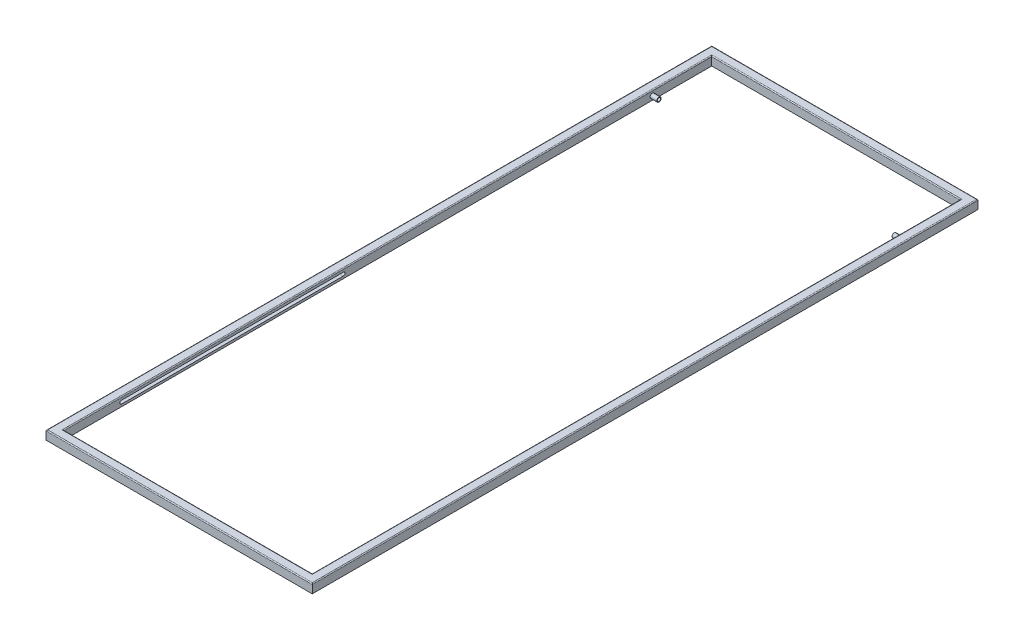
ISO-10303-21;
HEADER;
FILE_DESCRIPTION(('STEP AP214'),'2;1');
FILE_NAME('part.step','',(''),(''),'','','');
FILE_SCHEMA(('AUTOMOTIVE_DESIGN { 1 0 10303 214 1 1 1 1 }'));
ENDSEC;
DATA;
#1=APPLICATION_CONTEXT('core data for automotive mechanical design processes');
#2=APPLICATION_PROTOCOL_DEFINITION('international standard','automotive_design',2000,#1);
#3=PRODUCT_CONTEXT('',#1,'mechanical');
#4=PRODUCT('Part','Part','',(#3));
#5=PRODUCT_RELATED_PRODUCT_CATEGORY('part','',(#4));
#6=PRODUCT_DEFINITION_FORMATION('','',#4);
#7=PRODUCT_DEFINITION_CONTEXT('part definition',#1,'design');
#8=PRODUCT_DEFINITION('design','',#6,#7);
#9=PRODUCT_DEFINITION_SHAPE('','',#8);
#10=(LENGTH_UNIT() NAMED_UNIT(*) SI_UNIT(.MILLI.,.METRE.));
#11=(NAMED_UNIT(*) PLANE_ANGLE_UNIT() SI_UNIT($,.RADIAN.));
#12=(NAMED_UNIT(*) SI_UNIT($,.STERADIAN.) SOLID_ANGLE_UNIT());
#13=UNCERTAINTY_MEASURE_WITH_UNIT(LENGTH_MEASURE(1.E-05),#10,'distance_accuracy_value','');
#14=(GEOMETRIC_REPRESENTATION_CONTEXT(3) GLOBAL_UNCERTAINTY_ASSIGNED_CONTEXT((#13)) GLOBAL_UNIT_ASSIGNED_CONTEXT((#10,
#11,#12)) REPRESENTATION_CONTEXT('',''));
#15=CARTESIAN_POINT('',(0.,0.,0.));
#16=DIRECTION('',(0.,0.,1.));
#17=DIRECTION('',(1.,0.,0.));
#18=AXIS2_PLACEMENT_3D('',#15,#16,#17);
#19=CARTESIAN_POINT('',(0.,26.,0.));
#20=DIRECTION('',(0.,-1.,0.));
#21=DIRECTION('',(0.,0.,-1.));
#22=AXIS2_PLACEMENT_3D('',#19,#20,#21);
#23=PLANE('',#22);
#24=DIRECTION('',(0.,0.,1.));
#25=VECTOR('',#24,1.);
#26=CARTESIAN_POINT('',(-366.6,26.,-949.));
#27=LINE('',#26,#25);
#28=CARTESIAN_POINT('',(-366.6,26.,951.6));
#29=VERTEX_POINT('',#28);
#30=CARTESIAN_POINT('',(-366.6,26.,-951.6));
#31=VERTEX_POINT('',#30);
#32=EDGE_CURVE('E363',#29,#31,#27,.F.);
#33=ORIENTED_EDGE('',*,*,#32,.T.);
#34=DIRECTION('',(-1.,0.,0.));
#35=VECTOR('',#34,1.);
#36=CARTESIAN_POINT('',(364.,26.,-951.6));
#37=LINE('',#36,#35);
#38=CARTESIAN_POINT('',(366.6,26.,-951.6));
#39=VERTEX_POINT('',#38);
#40=EDGE_CURVE('E372',#31,#39,#37,.F.);
#41=ORIENTED_EDGE('',*,*,#40,.T.);
#42=DIRECTION('',(0.,0.,-1.));
#43=VECTOR('',#42,1.);
#44=CARTESIAN_POINT('',(366.6,26.,949.));
#45=LINE('',#44,#43);
#46=CARTESIAN_POINT('',(366.6,26.,951.6));
#47=VERTEX_POINT('',#46);
#48=EDGE_CURVE('E369',#39,#47,#45,.F.);
#49=ORIENTED_EDGE('',*,*,#48,.T.);
#50=DIRECTION('',(1.,0.,0.));
#51=VECTOR('',#50,1.);
#52=CARTESIAN_POINT('',(-364.,26.,951.6));
#53=LINE('',#52,#51);
#54=EDGE_CURVE('E366',#47,#29,#53,.F.);
#55=ORIENTED_EDGE('',*,*,#54,.T.);
#56=EDGE_LOOP('',(#33,#41,#49,#55));
#57=FACE_BOUND('',#56,.T.);
#58=DIRECTION('',(0.,0.,-1.));
#59=VECTOR('',#58,1.);
#60=CARTESIAN_POINT('',(387.4,26.,0.));
#61=LINE('',#60,#59);
#62=CARTESIAN_POINT('',(387.4,26.,972.4));
#63=VERTEX_POINT('',#62);
#64=CARTESIAN_POINT('',(387.4,26.,-972.4));
#65=VERTEX_POINT('',#64);
#66=EDGE_CURVE('E356',#63,#65,#61,.T.);
#67=ORIENTED_EDGE('',*,*,#66,.T.);
#68=DIRECTION('',(-1.,0.,0.));
#69=VECTOR('',#68,1.);
#70=CARTESIAN_POINT('',(0.,26.,-972.4));
#71=LINE('',#70,#69);
#72=CARTESIAN_POINT('',(-387.4,26.,-972.4));
#73=VERTEX_POINT('',#72);
#74=EDGE_CURVE('E359',#65,#73,#71,.T.);
#75=ORIENTED_EDGE('',*,*,#74,.T.);
#76=DIRECTION('',(0.,0.,1.));
#77=VECTOR('',#76,1.);
#78=CARTESIAN_POINT('',(-387.4,26.,0.));
#79=LINE('',#78,#77);
#80=CARTESIAN_POINT('',(-387.4,26.,972.4));
#81=VERTEX_POINT('',#80);
#82=EDGE_CURVE('E350',#73,#81,#79,.T.);
#83=ORIENTED_EDGE('',*,*,#82,.T.);
#84=DIRECTION('',(1.,0.,0.));
#85=VECTOR('',#84,1.);
#86=CARTESIAN_POINT('',(0.,26.,972.4));
#87=LINE('',#86,#85);
#88=EDGE_CURVE('E353',#81,#63,#87,.T.);
#89=ORIENTED_EDGE('',*,*,#88,.T.);
#90=EDGE_LOOP('',(#67,#75,#83,#89));
#91=FACE_BOUND('',#90,.T.);
#92=ADVANCED_FACE('F38',(#57,#91),#23,.F.);
#93=CARTESIAN_POINT('',(0.,0.,0.));
#94=DIRECTION('',(0.,-1.,0.));
#95=DIRECTION('',(0.,0.,-1.));
#96=AXIS2_PLACEMENT_3D('',#93,#94,#95);
#97=PLANE('',#96);
#98=CARTESIAN_POINT('',(-376.999999999999,0.,-962.000000000001));
#99=DIRECTION('',(0.,-1.,0.));
#100=DIRECTION('',(0.,0.,1.));
#101=AXIS2_PLACEMENT_3D('',#98,#99,#100);
#102=CIRCLE('',#101,6.49999999999999);
#103=CARTESIAN_POINT('',(-376.999999999999,0.,-955.500000000001));
#104=VERTEX_POINT('',#103);
#105=EDGE_CURVE('E278',#104,#104,#102,.T.);
#106=ORIENTED_EDGE('',*,*,#105,.F.);
#107=EDGE_LOOP('',(#106));
#108=FACE_BOUND('',#107,.T.);
#109=CARTESIAN_POINT('',(377.000000000001,0.,-962.));
#110=DIRECTION('',(0.,-1.,0.));
#111=DIRECTION('',(0.,0.,-1.));
#112=AXIS2_PLACEMENT_3D('',#109,#110,#111);
#113=CIRCLE('',#112,6.49999999999999);
#114=CARTESIAN_POINT('',(377.000000000001,0.,-968.5));
#115=VERTEX_POINT('',#114);
#116=EDGE_CURVE('E270',#115,#115,#113,.T.);
#117=ORIENTED_EDGE('',*,*,#116,.F.);
#118=EDGE_LOOP('',(#117));
#119=FACE_BOUND('',#118,.T.);
#120=CARTESIAN_POINT('',(377.,0.,962.));
#121=DIRECTION('',(0.,-1.,0.));
#122=DIRECTION('',(0.,0.,1.));
#123=AXIS2_PLACEMENT_3D('',#120,#121,#122);
#124=CIRCLE('',#123,6.49999999999999);
#125=CARTESIAN_POINT('',(377.,0.,968.5));
#126=VERTEX_POINT('',#125);
#127=EDGE_CURVE('E262',#126,#126,#124,.T.);
#128=ORIENTED_EDGE('',*,*,#127,.F.);
#129=EDGE_LOOP('',(#128));
#130=FACE_BOUND('',#129,.T.);
#131=CARTESIAN_POINT('',(-377.,0.,962.));
#132=DIRECTION('',(0.,-1.,0.));
#133=DIRECTION('',(0.,0.,-1.));
#134=AXIS2_PLACEMENT_3D('',#131,#132,#133);
#135=CIRCLE('',#134,6.49999999999999);
#136=CARTESIAN_POINT('',(-377.,0.,955.5));
#137=VERTEX_POINT('',#136);
#138=EDGE_CURVE('E261',#137,#137,#135,.T.);
#139=ORIENTED_EDGE('',*,*,#138,.F.);
#140=EDGE_LOOP('',(#139));
#141=FACE_BOUND('',#140,.T.);
#142=DIRECTION('',(0.,0.,-1.));
#143=VECTOR('',#142,1.);
#144=CARTESIAN_POINT('',(390.,0.,975.));
#145=LINE('',#144,#143);
#146=CARTESIAN_POINT('',(390.,0.,975.));
#147=VERTEX_POINT('',#146);
#148=CARTESIAN_POINT('',(390.,0.,-975.));
#149=VERTEX_POINT('',#148);
#150=EDGE_CURVE('E318',#147,#149,#145,.T.);
#151=ORIENTED_EDGE('',*,*,#150,.F.);
#152=DIRECTION('',(1.,0.,0.));
#153=VECTOR('',#152,1.);
#154=CARTESIAN_POINT('',(-390.,0.,975.));
#155=LINE('',#154,#153);
#156=CARTESIAN_POINT('',(-390.,0.,975.));
#157=VERTEX_POINT('',#156);
#158=EDGE_CURVE('E330',#157,#147,#155,.T.);
#159=ORIENTED_EDGE('',*,*,#158,.F.);
#160=DIRECTION('',(0.,0.,1.));
#161=VECTOR('',#160,1.);
#162=CARTESIAN_POINT('',(-390.,0.,975.));
#163=LINE('',#162,#161);
#164=CARTESIAN_POINT('',(-390.,0.,-975.));
#165=VERTEX_POINT('',#164);
#166=EDGE_CURVE('E326',#165,#157,#163,.T.);
#167=ORIENTED_EDGE('',*,*,#166,.F.);
#168=DIRECTION('',(-1.,0.,0.));
#169=VECTOR('',#168,1.);
#170=CARTESIAN_POINT('',(-390.,0.,-975.));
#171=LINE('',#170,#169);
#172=EDGE_CURVE('E322',#149,#165,#171,.T.);
#173=ORIENTED_EDGE('',*,*,#172,.F.);
#174=EDGE_LOOP('',(#151,#159,#167,#173));
#175=FACE_BOUND('',#174,.T.);
#176=DIRECTION('',(1.,0.,0.));
#177=VECTOR('',#176,1.);
#178=CARTESIAN_POINT('',(-364.,0.,949.));
#179=LINE('',#178,#177);
#180=CARTESIAN_POINT('',(-364.,0.,949.));
#181=VERTEX_POINT('',#180);
#182=CARTESIAN_POINT('',(364.,0.,949.));
#183=VERTEX_POINT('',#182);
#184=EDGE_CURVE('E302',#181,#183,#179,.T.);
#185=ORIENTED_EDGE('',*,*,#184,.T.);
#186=DIRECTION('',(0.,0.,-1.));
#187=VECTOR('',#186,1.);
#188=CARTESIAN_POINT('',(364.,0.,949.));
#189=LINE('',#188,#187);
#190=CARTESIAN_POINT('',(364.,0.,-949.));
#191=VERTEX_POINT('',#190);
#192=EDGE_CURVE('E287',#183,#191,#189,.T.);
#193=ORIENTED_EDGE('',*,*,#192,.T.);
#194=DIRECTION('',(-1.,0.,0.));
#195=VECTOR('',#194,1.);
#196=CARTESIAN_POINT('',(-364.,0.,-949.));
#197=LINE('',#196,#195);
#198=CARTESIAN_POINT('',(-364.,0.,-949.));
#199=VERTEX_POINT('',#198);
#200=EDGE_CURVE('E294',#191,#199,#197,.T.);
#201=ORIENTED_EDGE('',*,*,#200,.T.);
#202=DIRECTION('',(0.,0.,1.));
#203=VECTOR('',#202,1.);
#204=CARTESIAN_POINT('',(-364.,0.,949.));
#205=LINE('',#204,#203);
#206=EDGE_CURVE('E298',#199,#181,#205,.T.);
#207=ORIENTED_EDGE('',*,*,#206,.T.);
#208=EDGE_LOOP('',(#185,#193,#201,#207));
#209=FACE_BOUND('',#208,.T.);
#210=ADVANCED_FACE('F465',(#108,#119,#130,#141,#175,#209),#97,.T.);
#211=CARTESIAN_POINT('',(390.,26.,975.));
#212=DIRECTION('',(-1.,0.,0.));
#213=DIRECTION('',(0.,0.,1.));
#214=AXIS2_PLACEMENT_3D('',#211,#212,#213);
#215=PLANE('',#214);
#216=DIRECTION('',(0.,-1.,0.));
#217=VECTOR('',#216,1.);
#218=CARTESIAN_POINT('',(390.,26.,-975.));
#219=LINE('',#218,#217);
#220=CARTESIAN_POINT('',(390.,23.4,-975.));
#221=VERTEX_POINT('',#220);
#222=EDGE_CURVE('E343',#221,#149,#219,.T.);
#223=ORIENTED_EDGE('',*,*,#222,.F.);
#224=DIRECTION('',(0.,0.,-1.));
#225=VECTOR('',#224,1.);
#226=CARTESIAN_POINT('',(390.,23.4,975.));
#227=LINE('',#226,#225);
#228=CARTESIAN_POINT('',(390.,23.4,975.));
#229=VERTEX_POINT('',#228);
#230=EDGE_CURVE('E383',#221,#229,#227,.F.);
#231=ORIENTED_EDGE('',*,*,#230,.T.);
#232=DIRECTION('',(0.,-1.,0.));
#233=VECTOR('',#232,1.);
#234=CARTESIAN_POINT('',(390.,26.,975.));
#235=LINE('',#234,#233);
#236=EDGE_CURVE('E334',#229,#147,#235,.T.);
#237=ORIENTED_EDGE('',*,*,#236,.T.);
#238=ORIENTED_EDGE('',*,*,#150,.T.);
#239=EDGE_LOOP('',(#223,#231,#237,#238));
#240=FACE_BOUND('',#239,.T.);
#241=ADVANCED_FACE('F470',(#240),#215,.F.);
#242=CARTESIAN_POINT('',(-390.,26.,-975.));
#243=DIRECTION('',(0.,0.,1.));
#244=DIRECTION('',(1.,0.,0.));
#245=AXIS2_PLACEMENT_3D('',#242,#243,#244);
#246=PLANE('',#245);
#247=DIRECTION('',(0.,-1.,0.));
#248=VECTOR('',#247,1.);
#249=CARTESIAN_POINT('',(-390.,26.,-975.));
#250=LINE('',#249,#248);
#251=CARTESIAN_POINT('',(-390.,23.4,-975.));
#252=VERTEX_POINT('',#251);
#253=EDGE_CURVE('E340',#252,#165,#250,.T.);
#254=ORIENTED_EDGE('',*,*,#253,.F.);
#255=DIRECTION('',(-1.,0.,0.));
#256=VECTOR('',#255,1.);
#257=CARTESIAN_POINT('',(-390.,23.4,-975.));
#258=LINE('',#257,#256);
#259=EDGE_CURVE('E376',#252,#221,#258,.F.);
#260=ORIENTED_EDGE('',*,*,#259,.T.);
#261=ORIENTED_EDGE('',*,*,#222,.T.);
#262=ORIENTED_EDGE('',*,*,#172,.T.);
#263=EDGE_LOOP('',(#254,#260,#261,#262));
#264=FACE_BOUND('',#263,.T.);
#265=ADVANCED_FACE('F481',(#264),#246,.F.);
#266=CARTESIAN_POINT('',(-390.,26.,975.));
#267=DIRECTION('',(1.,0.,0.));
#268=DIRECTION('',(0.,0.,-1.));
#269=AXIS2_PLACEMENT_3D('',#266,#267,#268);
#270=PLANE('',#269);
#271=DIRECTION('',(0.,-1.,0.));
#272=VECTOR('',#271,1.);
#273=CARTESIAN_POINT('',(-390.,26.,975.));
#274=LINE('',#273,#272);
#275=CARTESIAN_POINT('',(-390.,23.4,975.));
#276=VERTEX_POINT('',#275);
#277=EDGE_CURVE('E337',#276,#157,#274,.T.);
#278=ORIENTED_EDGE('',*,*,#277,.F.);
#279=DIRECTION('',(0.,0.,1.));
#280=VECTOR('',#279,1.);
#281=CARTESIAN_POINT('',(-390.,23.4,975.));
#282=LINE('',#281,#280);
#283=EDGE_CURVE('E395',#276,#252,#282,.F.);
#284=ORIENTED_EDGE('',*,*,#283,.T.);
#285=ORIENTED_EDGE('',*,*,#253,.T.);
#286=ORIENTED_EDGE('',*,*,#166,.T.);
#287=EDGE_LOOP('',(#278,#284,#285,#286));
#288=FACE_BOUND('',#287,.T.);
#289=ADVANCED_FACE('F477',(#288),#270,.F.);
#290=CARTESIAN_POINT('',(-390.,26.,975.));
#291=DIRECTION('',(0.,0.,-1.));
#292=DIRECTION('',(-1.,0.,0.));
#293=AXIS2_PLACEMENT_3D('',#290,#291,#292);
#294=PLANE('',#293);
#295=ORIENTED_EDGE('',*,*,#236,.F.);
#296=DIRECTION('',(1.,0.,0.));
#297=VECTOR('',#296,1.);
#298=CARTESIAN_POINT('',(-390.,23.4,975.));
#299=LINE('',#298,#297);
#300=EDGE_CURVE('E389',#229,#276,#299,.F.);
#301=ORIENTED_EDGE('',*,*,#300,.T.);
#302=ORIENTED_EDGE('',*,*,#277,.T.);
#303=ORIENTED_EDGE('',*,*,#158,.T.);
#304=EDGE_LOOP('',(#295,#301,#302,#303));
#305=FACE_BOUND('',#304,.T.);
#306=ADVANCED_FACE('F462',(#305),#294,.F.);
#307=CARTESIAN_POINT('',(364.,26.,949.));
#308=DIRECTION('',(-1.,0.,0.));
#309=DIRECTION('',(0.,0.,1.));
#310=AXIS2_PLACEMENT_3D('',#307,#308,#309);
#311=PLANE('',#310);
#312=CARTESIAN_POINT('',(364.,11.7,-775.125));
#313=DIRECTION('',(-1.,0.,0.));
#314=DIRECTION('',(0.,0.,1.));
#315=AXIS2_PLACEMENT_3D('',#312,#313,#314);
#316=CIRCLE('',#315,6.50000000000006);
#317=CARTESIAN_POINT('',(364.,11.7,-768.625));
#318=VERTEX_POINT('',#317);
#319=EDGE_CURVE('E209',#318,#318,#316,.T.);
#320=ORIENTED_EDGE('',*,*,#319,.F.);
#321=EDGE_LOOP('',(#320));
#322=FACE_BOUND('',#321,.T.);
#323=CARTESIAN_POINT('',(364.,11.7,780.));
#324=DIRECTION('',(-1.,0.,0.));
#325=DIRECTION('',(0.,0.,1.));
#326=AXIS2_PLACEMENT_3D('',#323,#324,#325);
#327=CIRCLE('',#326,4.875);
#328=CARTESIAN_POINT('',(364.,6.825,780.));
#329=VERTEX_POINT('',#328);
#330=CARTESIAN_POINT('',(364.,16.575,780.));
#331=VERTEX_POINT('',#330);
#332=EDGE_CURVE('E184',#329,#331,#327,.T.);
#333=ORIENTED_EDGE('',*,*,#332,.F.);
#334=DIRECTION('',(0.,0.,-1.));
#335=VECTOR('',#334,1.);
#336=CARTESIAN_POINT('',(364.,6.825,949.));
#337=LINE('',#336,#335);
#338=CARTESIAN_POINT('',(364.,6.825,130.));
#339=VERTEX_POINT('',#338);
#340=EDGE_CURVE('E243',#329,#339,#337,.T.);
#341=ORIENTED_EDGE('',*,*,#340,.T.);
#342=CARTESIAN_POINT('',(364.,11.6999999999999,130.));
#343=DIRECTION('',(-1.,0.,0.));
#344=DIRECTION('',(0.,0.,1.));
#345=AXIS2_PLACEMENT_3D('',#342,#343,#344);
#346=CIRCLE('',#345,4.875);
#347=CARTESIAN_POINT('',(364.,16.575,130.));
#348=VERTEX_POINT('',#347);
#349=EDGE_CURVE('E247',#339,#348,#346,.F.);
#350=ORIENTED_EDGE('',*,*,#349,.T.);
#351=DIRECTION('',(0.,0.,-1.));
#352=VECTOR('',#351,1.);
#353=CARTESIAN_POINT('',(364.,16.575,949.));
#354=LINE('',#353,#352);
#355=EDGE_CURVE('E251',#331,#348,#354,.T.);
#356=ORIENTED_EDGE('',*,*,#355,.F.);
#357=EDGE_LOOP('',(#333,#341,#350,#356));
#358=FACE_BOUND('',#357,.T.);
#359=DIRECTION('',(0.,-1.,0.));
#360=VECTOR('',#359,1.);
#361=CARTESIAN_POINT('',(364.,26.,949.));
#362=LINE('',#361,#360);
#363=CARTESIAN_POINT('',(364.,23.4,949.));
#364=VERTEX_POINT('',#363);
#365=EDGE_CURVE('E306',#364,#183,#362,.T.);
#366=ORIENTED_EDGE('',*,*,#365,.F.);
#367=DIRECTION('',(0.,0.,-1.));
#368=VECTOR('',#367,1.);
#369=CARTESIAN_POINT('',(364.,23.4,-949.));
#370=LINE('',#369,#368);
#371=CARTESIAN_POINT('',(364.,23.4,-949.));
#372=VERTEX_POINT('',#371);
#373=EDGE_CURVE('E380',#364,#372,#370,.T.);
#374=ORIENTED_EDGE('',*,*,#373,.T.);
#375=DIRECTION('',(0.,-1.,0.));
#376=VECTOR('',#375,1.);
#377=CARTESIAN_POINT('',(364.,26.,-949.));
#378=LINE('',#377,#376);
#379=EDGE_CURVE('E315',#372,#191,#378,.T.);
#380=ORIENTED_EDGE('',*,*,#379,.T.);
#381=ORIENTED_EDGE('',*,*,#192,.F.);
#382=EDGE_LOOP('',(#366,#374,#380,#381));
#383=FACE_BOUND('',#382,.T.);
#384=ADVANCED_FACE('F447',(#322,#358,#383),#311,.T.);
#385=CARTESIAN_POINT('',(-364.,26.,-949.));
#386=DIRECTION('',(0.,0.,1.));
#387=DIRECTION('',(1.,0.,0.));
#388=AXIS2_PLACEMENT_3D('',#385,#386,#387);
#389=PLANE('',#388);
#390=ORIENTED_EDGE('',*,*,#379,.F.);
#391=DIRECTION('',(-1.,0.,0.));
#392=VECTOR('',#391,1.);
#393=CARTESIAN_POINT('',(-364.,23.4,-949.));
#394=LINE('',#393,#392);
#395=CARTESIAN_POINT('',(-364.,23.4,-949.));
#396=VERTEX_POINT('',#395);
#397=EDGE_CURVE('E346',#372,#396,#394,.T.);
#398=ORIENTED_EDGE('',*,*,#397,.T.);
#399=DIRECTION('',(0.,-1.,0.));
#400=VECTOR('',#399,1.);
#401=CARTESIAN_POINT('',(-364.,26.,-949.));
#402=LINE('',#401,#400);
#403=EDGE_CURVE('E312',#396,#199,#402,.T.);
#404=ORIENTED_EDGE('',*,*,#403,.T.);
#405=ORIENTED_EDGE('',*,*,#200,.F.);
#406=EDGE_LOOP('',(#390,#398,#404,#405));
#407=FACE_BOUND('',#406,.T.);
#408=ADVANCED_FACE('F461',(#407),#389,.T.);
#409=CARTESIAN_POINT('',(-364.,26.,949.));
#410=DIRECTION('',(1.,0.,0.));
#411=DIRECTION('',(0.,0.,-1.));
#412=AXIS2_PLACEMENT_3D('',#409,#410,#411);
#413=PLANE('',#412);
#414=CARTESIAN_POINT('',(-364.,11.7,-775.125));
#415=DIRECTION('',(1.,0.,0.));
#416=DIRECTION('',(0.,0.,-1.));
#417=AXIS2_PLACEMENT_3D('',#414,#415,#416);
#418=CIRCLE('',#417,6.50000000000006);
#419=CARTESIAN_POINT('',(-364.,11.7,-781.625));
#420=VERTEX_POINT('',#419);
#421=EDGE_CURVE('E11',#420,#420,#418,.T.);
#422=ORIENTED_EDGE('',*,*,#421,.F.);
#423=EDGE_LOOP('',(#422));
#424=FACE_BOUND('',#423,.T.);
#425=CARTESIAN_POINT('',(-364.,11.7,780.));
#426=DIRECTION('',(1.,0.,0.));
#427=DIRECTION('',(0.,0.,-1.));
#428=AXIS2_PLACEMENT_3D('',#425,#426,#427);
#429=CIRCLE('',#428,4.875);
#430=CARTESIAN_POINT('',(-364.,16.575,780.));
#431=VERTEX_POINT('',#430);
#432=CARTESIAN_POINT('',(-364.,6.825,780.));
#433=VERTEX_POINT('',#432);
#434=EDGE_CURVE('E435',#431,#433,#429,.T.);
#435=ORIENTED_EDGE('',*,*,#434,.F.);
#436=DIRECTION('',(0.,0.,1.));
#437=VECTOR('',#436,1.);
#438=CARTESIAN_POINT('',(-364.,16.575,949.));
#439=LINE('',#438,#437);
#440=CARTESIAN_POINT('',(-364.,16.575,130.));
#441=VERTEX_POINT('',#440);
#442=EDGE_CURVE('E432',#441,#431,#439,.T.);
#443=ORIENTED_EDGE('',*,*,#442,.F.);
#444=CARTESIAN_POINT('',(-364.,11.6999999999999,130.));
#445=DIRECTION('',(1.,0.,0.));
#446=DIRECTION('',(0.,0.,-1.));
#447=AXIS2_PLACEMENT_3D('',#444,#445,#446);
#448=CIRCLE('',#447,4.875);
#449=CARTESIAN_POINT('',(-364.,6.825,130.));
#450=VERTEX_POINT('',#449);
#451=EDGE_CURVE('E428',#441,#450,#448,.F.);
#452=ORIENTED_EDGE('',*,*,#451,.T.);
#453=DIRECTION('',(0.,0.,1.));
#454=VECTOR('',#453,1.);
#455=CARTESIAN_POINT('',(-364.,6.825,949.));
#456=LINE('',#455,#454);
#457=EDGE_CURVE('E398',#450,#433,#456,.T.);
#458=ORIENTED_EDGE('',*,*,#457,.T.);
#459=EDGE_LOOP('',(#435,#443,#452,#458));
#460=FACE_BOUND('',#459,.T.);
#461=ORIENTED_EDGE('',*,*,#403,.F.);
#462=DIRECTION('',(0.,0.,1.));
#463=VECTOR('',#462,1.);
#464=CARTESIAN_POINT('',(-364.,23.4,949.));
#465=LINE('',#464,#463);
#466=CARTESIAN_POINT('',(-364.,23.4,949.));
#467=VERTEX_POINT('',#466);
#468=EDGE_CURVE('E392',#396,#467,#465,.T.);
#469=ORIENTED_EDGE('',*,*,#468,.T.);
#470=DIRECTION('',(0.,-1.,0.));
#471=VECTOR('',#470,1.);
#472=CARTESIAN_POINT('',(-364.,26.,949.));
#473=LINE('',#472,#471);
#474=EDGE_CURVE('E309',#467,#181,#473,.T.);
#475=ORIENTED_EDGE('',*,*,#474,.T.);
#476=ORIENTED_EDGE('',*,*,#206,.F.);
#477=EDGE_LOOP('',(#461,#469,#475,#476));
#478=FACE_BOUND('',#477,.T.);
#479=ADVANCED_FACE('F561',(#424,#460,#478),#413,.T.);
#480=CARTESIAN_POINT('',(-364.,26.,949.));
#481=DIRECTION('',(0.,0.,-1.));
#482=DIRECTION('',(-1.,0.,0.));
#483=AXIS2_PLACEMENT_3D('',#480,#481,#482);
#484=PLANE('',#483);
#485=ORIENTED_EDGE('',*,*,#474,.F.);
#486=DIRECTION('',(1.,0.,0.));
#487=VECTOR('',#486,1.);
#488=CARTESIAN_POINT('',(364.,23.4,949.));
#489=LINE('',#488,#487);
#490=EDGE_CURVE('E386',#467,#364,#489,.T.);
#491=ORIENTED_EDGE('',*,*,#490,.T.);
#492=ORIENTED_EDGE('',*,*,#365,.T.);
#493=ORIENTED_EDGE('',*,*,#184,.F.);
#494=EDGE_LOOP('',(#485,#491,#492,#493));
#495=FACE_BOUND('',#494,.T.);
#496=ADVANCED_FACE('F548',(#495),#484,.T.);
#497=CARTESIAN_POINT('',(-377.,19.5,962.));
#498=DIRECTION('',(0.,-1.,0.));
#499=DIRECTION('',(0.,0.,-1.));
#500=AXIS2_PLACEMENT_3D('',#497,#498,#499);
#501=CYLINDRICAL_SURFACE('',#500,6.49999999999999);
#502=CARTESIAN_POINT('',(-377.,19.5,962.));
#503=DIRECTION('',(0.,-1.,0.));
#504=DIRECTION('',(0.,0.,-1.));
#505=AXIS2_PLACEMENT_3D('',#502,#503,#504);
#506=CIRCLE('',#505,6.49999999999999);
#507=CARTESIAN_POINT('',(-377.,19.5,955.5));
#508=VERTEX_POINT('',#507);
#509=EDGE_CURVE('E283',#508,#508,#506,.T.);
#510=ORIENTED_EDGE('',*,*,#509,.F.);
#511=EDGE_LOOP('',(#510));
#512=FACE_BOUND('',#511,.T.);
#513=ORIENTED_EDGE('',*,*,#138,.T.);
#514=EDGE_LOOP('',(#513));
#515=FACE_BOUND('',#514,.T.);
#516=ADVANCED_FACE('F577',(#512,#515),#501,.F.);
#517=CARTESIAN_POINT('',(-377.,19.5,962.));
#518=DIRECTION('',(0.,-1.,0.));
#519=DIRECTION('',(0.,0.,-1.));
#520=AXIS2_PLACEMENT_3D('',#517,#518,#519);
#521=PLANE('',#520);
#522=ORIENTED_EDGE('',*,*,#509,.T.);
#523=EDGE_LOOP('',(#522));
#524=FACE_BOUND('',#523,.T.);
#525=ADVANCED_FACE('F670',(#524),#521,.T.);
#526=CARTESIAN_POINT('',(377.,19.5,962.));
#527=DIRECTION('',(0.,-1.,0.));
#528=DIRECTION('',(0.,0.,-1.));
#529=AXIS2_PLACEMENT_3D('',#526,#527,#528);
#530=CYLINDRICAL_SURFACE('',#529,6.49999999999999);
#531=CARTESIAN_POINT('',(377.,19.5,962.));
#532=DIRECTION('',(0.,-1.,0.));
#533=DIRECTION('',(0.,0.,1.));
#534=AXIS2_PLACEMENT_3D('',#531,#532,#533);
#535=CIRCLE('',#534,6.49999999999999);
#536=CARTESIAN_POINT('',(377.,19.5,968.5));
#537=VERTEX_POINT('',#536);
#538=EDGE_CURVE('E257',#537,#537,#535,.T.);
#539=ORIENTED_EDGE('',*,*,#538,.F.);
#540=EDGE_LOOP('',(#539));
#541=FACE_BOUND('',#540,.T.);
#542=ORIENTED_EDGE('',*,*,#127,.T.);
#543=EDGE_LOOP('',(#542));
#544=FACE_BOUND('',#543,.T.);
#545=ADVANCED_FACE('F666',(#541,#544),#530,.F.);
#546=CARTESIAN_POINT('',(377.,19.5,962.));
#547=DIRECTION('',(0.,1.,0.));
#548=DIRECTION('',(0.,0.,1.));
#549=AXIS2_PLACEMENT_3D('',#546,#547,#548);
#550=PLANE('',#549);
#551=ORIENTED_EDGE('',*,*,#538,.T.);
#552=EDGE_LOOP('',(#551));
#553=FACE_BOUND('',#552,.T.);
#554=ADVANCED_FACE('F662',(#553),#550,.F.);
#555=CARTESIAN_POINT('',(377.000000000001,19.5,-962.));
#556=DIRECTION('',(0.,-1.,0.));
#557=DIRECTION('',(0.,0.,-1.));
#558=AXIS2_PLACEMENT_3D('',#555,#556,#557);
#559=CYLINDRICAL_SURFACE('',#558,6.49999999999999);
#560=CARTESIAN_POINT('',(377.000000000001,19.5,-962.));
#561=DIRECTION('',(0.,-1.,0.));
#562=DIRECTION('',(0.,0.,-1.));
#563=AXIS2_PLACEMENT_3D('',#560,#561,#562);
#564=CIRCLE('',#563,6.49999999999999);
#565=CARTESIAN_POINT('',(377.000000000001,19.5,-968.5));
#566=VERTEX_POINT('',#565);
#567=EDGE_CURVE('E266',#566,#566,#564,.T.);
#568=ORIENTED_EDGE('',*,*,#567,.F.);
#569=EDGE_LOOP('',(#568));
#570=FACE_BOUND('',#569,.T.);
#571=ORIENTED_EDGE('',*,*,#116,.T.);
#572=EDGE_LOOP('',(#571));
#573=FACE_BOUND('',#572,.T.);
#574=ADVANCED_FACE('F665',(#570,#573),#559,.F.);
#575=CARTESIAN_POINT('',(377.000000000001,19.5,-962.));
#576=DIRECTION('',(0.,-1.,0.));
#577=DIRECTION('',(0.,0.,-1.));
#578=AXIS2_PLACEMENT_3D('',#575,#576,#577);
#579=PLANE('',#578);
#580=ORIENTED_EDGE('',*,*,#567,.T.);
#581=EDGE_LOOP('',(#580));
#582=FACE_BOUND('',#581,.T.);
#583=ADVANCED_FACE('F672',(#582),#579,.T.);
#584=CARTESIAN_POINT('',(-376.999999999999,19.5,-962.000000000001));
#585=DIRECTION('',(0.,-1.,0.));
#586=DIRECTION('',(0.,0.,-1.));
#587=AXIS2_PLACEMENT_3D('',#584,#585,#586);
#588=CYLINDRICAL_SURFACE('',#587,6.49999999999999);
#589=CARTESIAN_POINT('',(-376.999999999999,19.5,-962.000000000001));
#590=DIRECTION('',(0.,-1.,0.));
#591=DIRECTION('',(0.,0.,1.));
#592=AXIS2_PLACEMENT_3D('',#589,#590,#591);
#593=CIRCLE('',#592,6.49999999999999);
#594=CARTESIAN_POINT('',(-376.999999999999,19.5,-955.500000000001));
#595=VERTEX_POINT('',#594);
#596=EDGE_CURVE('E274',#595,#595,#593,.T.);
#597=ORIENTED_EDGE('',*,*,#596,.F.);
#598=EDGE_LOOP('',(#597));
#599=FACE_BOUND('',#598,.T.);
#600=ORIENTED_EDGE('',*,*,#105,.T.);
#601=EDGE_LOOP('',(#600));
#602=FACE_BOUND('',#601,.T.);
#603=ADVANCED_FACE('F675',(#599,#602),#588,.F.);
#604=CARTESIAN_POINT('',(-376.999999999999,19.5,-962.000000000001));
#605=DIRECTION('',(0.,1.,0.));
#606=DIRECTION('',(0.,0.,1.));
#607=AXIS2_PLACEMENT_3D('',#604,#605,#606);
#608=PLANE('',#607);
#609=ORIENTED_EDGE('',*,*,#596,.T.);
#610=EDGE_LOOP('',(#609));
#611=FACE_BOUND('',#610,.T.);
#612=ADVANCED_FACE('F504',(#611),#608,.F.);
#613=CARTESIAN_POINT('',(-364.,23.4,951.6));
#614=DIRECTION('',(-1.,0.,0.));
#615=DIRECTION('',(0.,0.,1.));
#616=AXIS2_PLACEMENT_3D('',#613,#614,#615);
#617=CYLINDRICAL_SURFACE('',#616,2.6);
#618=CARTESIAN_POINT('',(-366.6,23.4,951.6));
#619=DIRECTION('',(-0.707106781186547,0.,-0.707106781186547));
#620=DIRECTION('',(-0.707106781186547,0.,0.707106781186547));
#621=AXIS2_PLACEMENT_3D('',#618,#619,#620);
#622=ELLIPSE('',#621,3.67695526217005,2.6);
#623=EDGE_CURVE('E406',#29,#467,#622,.T.);
#624=ORIENTED_EDGE('',*,*,#623,.F.);
#625=ORIENTED_EDGE('',*,*,#54,.F.);
#626=CARTESIAN_POINT('',(366.6,23.4,951.6));
#627=DIRECTION('',(-0.707106781186547,0.,0.707106781186547));
#628=DIRECTION('',(0.707106781186547,0.,0.707106781186547));
#629=AXIS2_PLACEMENT_3D('',#626,#627,#628);
#630=ELLIPSE('',#629,3.67695526217005,2.6);
#631=EDGE_CURVE('E282',#364,#47,#630,.F.);
#632=ORIENTED_EDGE('',*,*,#631,.F.);
#633=ORIENTED_EDGE('',*,*,#490,.F.);
#634=EDGE_LOOP('',(#624,#625,#632,#633));
#635=FACE_BOUND('',#634,.T.);
#636=ADVANCED_FACE('F500',(#635),#617,.T.);
#637=CARTESIAN_POINT('',(366.6,23.4,949.));
#638=DIRECTION('',(0.,0.,1.));
#639=DIRECTION('',(1.,0.,0.));
#640=AXIS2_PLACEMENT_3D('',#637,#638,#639);
#641=CYLINDRICAL_SURFACE('',#640,2.6);
#642=ORIENTED_EDGE('',*,*,#631,.T.);
#643=ORIENTED_EDGE('',*,*,#48,.F.);
#644=CARTESIAN_POINT('',(366.6,23.4,-951.6));
#645=DIRECTION('',(0.707106781186547,0.,0.707106781186547));
#646=DIRECTION('',(0.707106781186547,0.,-0.707106781186547));
#647=AXIS2_PLACEMENT_3D('',#644,#645,#646);
#648=ELLIPSE('',#647,3.67695526217005,2.6);
#649=EDGE_CURVE('E402',#372,#39,#648,.F.);
#650=ORIENTED_EDGE('',*,*,#649,.F.);
#651=ORIENTED_EDGE('',*,*,#373,.F.);
#652=EDGE_LOOP('',(#642,#643,#650,#651));
#653=FACE_BOUND('',#652,.T.);
#654=ADVANCED_FACE('F496',(#653),#641,.T.);
#655=CARTESIAN_POINT('',(-366.6,23.4,949.));
#656=DIRECTION('',(0.,0.,-1.));
#657=DIRECTION('',(-1.,0.,0.));
#658=AXIS2_PLACEMENT_3D('',#655,#656,#657);
#659=CYLINDRICAL_SURFACE('',#658,2.6);
#660=ORIENTED_EDGE('',*,*,#623,.T.);
#661=ORIENTED_EDGE('',*,*,#468,.F.);
#662=CARTESIAN_POINT('',(-366.6,23.4,-951.6));
#663=DIRECTION('',(0.707106781186547,0.,-0.707106781186547));
#664=DIRECTION('',(0.707106781186547,0.,0.707106781186547));
#665=AXIS2_PLACEMENT_3D('',#662,#663,#664);
#666=ELLIPSE('',#665,3.67695526217005,2.6);
#667=EDGE_CURVE('E399',#31,#396,#666,.T.);
#668=ORIENTED_EDGE('',*,*,#667,.F.);
#669=ORIENTED_EDGE('',*,*,#32,.F.);
#670=EDGE_LOOP('',(#660,#661,#668,#669));
#671=FACE_BOUND('',#670,.T.);
#672=ADVANCED_FACE('F492',(#671),#659,.T.);
#673=CARTESIAN_POINT('',(-364.,23.4,-951.6));
#674=DIRECTION('',(1.,0.,0.));
#675=DIRECTION('',(0.,0.,-1.));
#676=AXIS2_PLACEMENT_3D('',#673,#674,#675);
#677=CYLINDRICAL_SURFACE('',#676,2.6);
#678=ORIENTED_EDGE('',*,*,#649,.T.);
#679=ORIENTED_EDGE('',*,*,#40,.F.);
#680=ORIENTED_EDGE('',*,*,#667,.T.);
#681=ORIENTED_EDGE('',*,*,#397,.F.);
#682=EDGE_LOOP('',(#678,#679,#680,#681));
#683=FACE_BOUND('',#682,.T.);
#684=ADVANCED_FACE('F489',(#683),#677,.T.);
#685=CARTESIAN_POINT('',(0.,23.4,972.4));
#686=DIRECTION('',(1.,0.,0.));
#687=DIRECTION('',(0.,0.,-1.));
#688=AXIS2_PLACEMENT_3D('',#685,#686,#687);
#689=CYLINDRICAL_SURFACE('',#688,2.6);
#690=CARTESIAN_POINT('',(-387.4,23.4,972.4));
#691=DIRECTION('',(0.707106781186547,0.,0.707106781186547));
#692=DIRECTION('',(-0.707106781186547,0.,0.707106781186547));
#693=AXIS2_PLACEMENT_3D('',#690,#691,#692);
#694=ELLIPSE('',#693,3.67695526217005,2.6);
#695=EDGE_CURVE('E418',#276,#81,#694,.F.);
#696=ORIENTED_EDGE('',*,*,#695,.F.);
#697=ORIENTED_EDGE('',*,*,#300,.F.);
#698=CARTESIAN_POINT('',(387.4,23.4,972.4));
#699=DIRECTION('',(0.707106781186547,0.,-0.707106781186547));
#700=DIRECTION('',(0.707106781186547,0.,0.707106781186547));
#701=AXIS2_PLACEMENT_3D('',#698,#699,#700);
#702=ELLIPSE('',#701,3.67695526217005,2.6);
#703=EDGE_CURVE('E403',#63,#229,#702,.T.);
#704=ORIENTED_EDGE('',*,*,#703,.F.);
#705=ORIENTED_EDGE('',*,*,#88,.F.);
#706=EDGE_LOOP('',(#696,#697,#704,#705));
#707=FACE_BOUND('',#706,.T.);
#708=ADVANCED_FACE('F40',(#707),#689,.T.);
#709=CARTESIAN_POINT('',(387.4,23.4,0.));
#710=DIRECTION('',(0.,0.,-1.));
#711=DIRECTION('',(-1.,0.,0.));
#712=AXIS2_PLACEMENT_3D('',#709,#710,#711);
#713=CYLINDRICAL_SURFACE('',#712,2.6);
#714=ORIENTED_EDGE('',*,*,#703,.T.);
#715=ORIENTED_EDGE('',*,*,#230,.F.);
#716=CARTESIAN_POINT('',(387.4,23.4,-972.4));
#717=DIRECTION('',(-0.707106781186547,0.,-0.707106781186547));
#718=DIRECTION('',(0.707106781186547,0.,-0.707106781186547));
#719=AXIS2_PLACEMENT_3D('',#716,#717,#718);
#720=ELLIPSE('',#719,3.67695526217005,2.6);
#721=EDGE_CURVE('E415',#65,#221,#720,.T.);
#722=ORIENTED_EDGE('',*,*,#721,.F.);
#723=ORIENTED_EDGE('',*,*,#66,.F.);
#724=EDGE_LOOP('',(#714,#715,#722,#723));
#725=FACE_BOUND('',#724,.T.);
#726=ADVANCED_FACE('F513',(#725),#713,.T.);
#727=CARTESIAN_POINT('',(-387.4,23.4,0.));
#728=DIRECTION('',(0.,0.,1.));
#729=DIRECTION('',(1.,0.,0.));
#730=AXIS2_PLACEMENT_3D('',#727,#728,#729);
#731=CYLINDRICAL_SURFACE('',#730,2.6);
#732=ORIENTED_EDGE('',*,*,#695,.T.);
#733=ORIENTED_EDGE('',*,*,#82,.F.);
#734=CARTESIAN_POINT('',(-387.4,23.4,-972.4));
#735=DIRECTION('',(-0.707106781186547,0.,0.707106781186547));
#736=DIRECTION('',(0.707106781186547,0.,0.707106781186547));
#737=AXIS2_PLACEMENT_3D('',#734,#735,#736);
#738=ELLIPSE('',#737,3.67695526217005,2.6);
#739=EDGE_CURVE('E256',#252,#73,#738,.F.);
#740=ORIENTED_EDGE('',*,*,#739,.F.);
#741=ORIENTED_EDGE('',*,*,#283,.F.);
#742=EDGE_LOOP('',(#732,#733,#740,#741));
#743=FACE_BOUND('',#742,.T.);
#744=ADVANCED_FACE('F510',(#743),#731,.T.);
#745=CARTESIAN_POINT('',(0.,23.4,-972.4));
#746=DIRECTION('',(-1.,0.,0.));
#747=DIRECTION('',(0.,0.,1.));
#748=AXIS2_PLACEMENT_3D('',#745,#746,#747);
#749=CYLINDRICAL_SURFACE('',#748,2.6);
#750=ORIENTED_EDGE('',*,*,#721,.T.);
#751=ORIENTED_EDGE('',*,*,#259,.F.);
#752=ORIENTED_EDGE('',*,*,#739,.T.);
#753=ORIENTED_EDGE('',*,*,#74,.F.);
#754=EDGE_LOOP('',(#750,#751,#752,#753));
#755=FACE_BOUND('',#754,.T.);
#756=ADVANCED_FACE('F506',(#755),#749,.T.);
#757=CARTESIAN_POINT('',(-383.5,0.,0.));
#758=DIRECTION('',(-1.,0.,0.));
#759=DIRECTION('',(0.,0.,1.));
#760=AXIS2_PLACEMENT_3D('',#757,#758,#759);
#761=PLANE('',#760);
#762=CARTESIAN_POINT('',(-383.5,11.7,780.));
#763=DIRECTION('',(-1.,0.,0.));
#764=DIRECTION('',(0.,0.,1.));
#765=AXIS2_PLACEMENT_3D('',#762,#763,#764);
#766=CIRCLE('',#765,4.875);
#767=CARTESIAN_POINT('',(-383.5,16.575,780.));
#768=VERTEX_POINT('',#767);
#769=CARTESIAN_POINT('',(-383.5,6.825,780.));
#770=VERTEX_POINT('',#769);
#771=EDGE_CURVE('E217',#768,#770,#766,.F.);
#772=ORIENTED_EDGE('',*,*,#771,.T.);
#773=DIRECTION('',(0.,0.,1.));
#774=VECTOR('',#773,1.);
#775=CARTESIAN_POINT('',(-383.5,6.825,0.));
#776=LINE('',#775,#774);
#777=CARTESIAN_POINT('',(-383.5,6.825,130.));
#778=VERTEX_POINT('',#777);
#779=EDGE_CURVE('E228',#778,#770,#776,.T.);
#780=ORIENTED_EDGE('',*,*,#779,.F.);
#781=CARTESIAN_POINT('',(-383.5,11.6999999999999,130.));
#782=DIRECTION('',(-1.,0.,0.));
#783=DIRECTION('',(0.,0.,1.));
#784=AXIS2_PLACEMENT_3D('',#781,#782,#783);
#785=CIRCLE('',#784,4.875);
#786=CARTESIAN_POINT('',(-383.5,16.575,130.));
#787=VERTEX_POINT('',#786);
#788=EDGE_CURVE('E225',#787,#778,#785,.T.);
#789=ORIENTED_EDGE('',*,*,#788,.F.);
#790=DIRECTION('',(0.,0.,1.));
#791=VECTOR('',#790,1.);
#792=CARTESIAN_POINT('',(-383.5,16.575,0.));
#793=LINE('',#792,#791);
#794=EDGE_CURVE('E221',#787,#768,#793,.T.);
#795=ORIENTED_EDGE('',*,*,#794,.T.);
#796=EDGE_LOOP('',(#772,#780,#789,#795));
#797=FACE_BOUND('',#796,.T.);
#798=ADVANCED_FACE('F509',(#797),#761,.F.);
#799=CARTESIAN_POINT('',(-383.5,6.825,0.));
#800=DIRECTION('',(0.,1.,0.));
#801=DIRECTION('',(0.,0.,1.));
#802=AXIS2_PLACEMENT_3D('',#799,#800,#801);
#803=PLANE('',#802);
#804=DIRECTION('',(1.,0.,0.));
#805=VECTOR('',#804,1.);
#806=CARTESIAN_POINT('',(-383.5,6.825,130.));
#807=LINE('',#806,#805);
#808=EDGE_CURVE('E234',#778,#450,#807,.T.);
#809=ORIENTED_EDGE('',*,*,#808,.F.);
#810=ORIENTED_EDGE('',*,*,#779,.T.);
#811=DIRECTION('',(1.,0.,0.));
#812=VECTOR('',#811,1.);
#813=CARTESIAN_POINT('',(-383.5,6.825,780.));
#814=LINE('',#813,#812);
#815=EDGE_CURVE('E62',#770,#433,#814,.T.);
#816=ORIENTED_EDGE('',*,*,#815,.T.);
#817=ORIENTED_EDGE('',*,*,#457,.F.);
#818=EDGE_LOOP('',(#809,#810,#816,#817));
#819=FACE_BOUND('',#818,.T.);
#820=ADVANCED_FACE('F621',(#819),#803,.T.);
#821=CARTESIAN_POINT('',(-383.5,11.6999999999999,130.));
#822=DIRECTION('',(1.,0.,0.));
#823=DIRECTION('',(0.,0.,-1.));
#824=AXIS2_PLACEMENT_3D('',#821,#822,#823);
#825=CYLINDRICAL_SURFACE('',#824,4.875);
#826=DIRECTION('',(1.,0.,0.));
#827=VECTOR('',#826,1.);
#828=CARTESIAN_POINT('',(-383.5,16.575,130.));
#829=LINE('',#828,#827);
#830=EDGE_CURVE('E189',#787,#441,#829,.T.);
#831=ORIENTED_EDGE('',*,*,#830,.F.);
#832=ORIENTED_EDGE('',*,*,#788,.T.);
#833=ORIENTED_EDGE('',*,*,#808,.T.);
#834=ORIENTED_EDGE('',*,*,#451,.F.);
#835=EDGE_LOOP('',(#831,#832,#833,#834));
#836=FACE_BOUND('',#835,.T.);
#837=ADVANCED_FACE('F629',(#836),#825,.F.);
#838=CARTESIAN_POINT('',(-383.5,16.575,0.));
#839=DIRECTION('',(0.,1.,0.));
#840=DIRECTION('',(0.,0.,1.));
#841=AXIS2_PLACEMENT_3D('',#838,#839,#840);
#842=PLANE('',#841);
#843=ORIENTED_EDGE('',*,*,#442,.T.);
#844=DIRECTION('',(1.,0.,0.));
#845=VECTOR('',#844,1.);
#846=CARTESIAN_POINT('',(-383.5,16.575,780.));
#847=LINE('',#846,#845);
#848=EDGE_CURVE('E188',#768,#431,#847,.T.);
#849=ORIENTED_EDGE('',*,*,#848,.F.);
#850=ORIENTED_EDGE('',*,*,#794,.F.);
#851=ORIENTED_EDGE('',*,*,#830,.T.);
#852=EDGE_LOOP('',(#843,#849,#850,#851));
#853=FACE_BOUND('',#852,.T.);
#854=ADVANCED_FACE('F636',(#853),#842,.F.);
#855=CARTESIAN_POINT('',(-383.5,11.7,780.));
#856=DIRECTION('',(1.,0.,0.));
#857=DIRECTION('',(0.,0.,-1.));
#858=AXIS2_PLACEMENT_3D('',#855,#856,#857);
#859=CYLINDRICAL_SURFACE('',#858,4.875);
#860=ORIENTED_EDGE('',*,*,#434,.T.);
#861=ORIENTED_EDGE('',*,*,#815,.F.);
#862=ORIENTED_EDGE('',*,*,#771,.F.);
#863=ORIENTED_EDGE('',*,*,#848,.T.);
#864=EDGE_LOOP('',(#860,#861,#862,#863));
#865=FACE_BOUND('',#864,.T.);
#866=ADVANCED_FACE('F645',(#865),#859,.F.);
#867=ORIENTED_EDGE('',*,*,#332,.T.);
#868=CARTESIAN_POINT('',(383.5,16.575,780.));
#869=VERTEX_POINT('',#868);
#870=EDGE_CURVE('E176',#331,#869,#847,.T.);
#871=ORIENTED_EDGE('',*,*,#870,.T.);
#872=CARTESIAN_POINT('',(383.5,11.7,780.));
#873=DIRECTION('',(-1.,0.,0.));
#874=DIRECTION('',(0.,0.,1.));
#875=AXIS2_PLACEMENT_3D('',#872,#873,#874);
#876=CIRCLE('',#875,4.875);
#877=CARTESIAN_POINT('',(383.5,6.825,780.));
#878=VERTEX_POINT('',#877);
#879=EDGE_CURVE('E181',#869,#878,#876,.F.);
#880=ORIENTED_EDGE('',*,*,#879,.T.);
#881=EDGE_CURVE('E231',#329,#878,#814,.T.);
#882=ORIENTED_EDGE('',*,*,#881,.F.);
#883=EDGE_LOOP('',(#867,#871,#880,#882));
#884=FACE_BOUND('',#883,.T.);
#885=ADVANCED_FACE('F178',(#884),#859,.F.);
#886=ORIENTED_EDGE('',*,*,#355,.T.);
#887=CARTESIAN_POINT('',(383.5,16.575,130.));
#888=VERTEX_POINT('',#887);
#889=EDGE_CURVE('E195',#348,#888,#829,.T.);
#890=ORIENTED_EDGE('',*,*,#889,.T.);
#891=DIRECTION('',(0.,0.,1.));
#892=VECTOR('',#891,1.);
#893=CARTESIAN_POINT('',(383.5,16.575,0.));
#894=LINE('',#893,#892);
#895=EDGE_CURVE('E192',#888,#869,#894,.T.);
#896=ORIENTED_EDGE('',*,*,#895,.T.);
#897=ORIENTED_EDGE('',*,*,#870,.F.);
#898=EDGE_LOOP('',(#886,#890,#896,#897));
#899=FACE_BOUND('',#898,.T.);
#900=ADVANCED_FACE('F193',(#899),#842,.F.);
#901=CARTESIAN_POINT('',(383.5,6.825,130.));
#902=VERTEX_POINT('',#901);
#903=EDGE_CURVE('E54',#339,#902,#807,.T.);
#904=ORIENTED_EDGE('',*,*,#903,.T.);
#905=CARTESIAN_POINT('',(383.5,11.6999999999999,130.));
#906=DIRECTION('',(-1.,0.,0.));
#907=DIRECTION('',(0.,0.,1.));
#908=AXIS2_PLACEMENT_3D('',#905,#906,#907);
#909=CIRCLE('',#908,4.875);
#910=EDGE_CURVE('E200',#888,#902,#909,.T.);
#911=ORIENTED_EDGE('',*,*,#910,.F.);
#912=ORIENTED_EDGE('',*,*,#889,.F.);
#913=ORIENTED_EDGE('',*,*,#349,.F.);
#914=EDGE_LOOP('',(#904,#911,#912,#913));
#915=FACE_BOUND('',#914,.T.);
#916=ADVANCED_FACE('F614',(#915),#825,.F.);
#917=ORIENTED_EDGE('',*,*,#881,.T.);
#918=DIRECTION('',(0.,0.,1.));
#919=VECTOR('',#918,1.);
#920=CARTESIAN_POINT('',(383.5,6.825,0.));
#921=LINE('',#920,#919);
#922=EDGE_CURVE('E203',#902,#878,#921,.T.);
#923=ORIENTED_EDGE('',*,*,#922,.F.);
#924=ORIENTED_EDGE('',*,*,#903,.F.);
#925=ORIENTED_EDGE('',*,*,#340,.F.);
#926=EDGE_LOOP('',(#917,#923,#924,#925));
#927=FACE_BOUND('',#926,.T.);
#928=ADVANCED_FACE('F618',(#927),#803,.T.);
#929=CARTESIAN_POINT('',(383.5,0.,0.));
#930=DIRECTION('',(-1.,0.,0.));
#931=DIRECTION('',(0.,0.,1.));
#932=AXIS2_PLACEMENT_3D('',#929,#930,#931);
#933=PLANE('',#932);
#934=ORIENTED_EDGE('',*,*,#879,.F.);
#935=ORIENTED_EDGE('',*,*,#895,.F.);
#936=ORIENTED_EDGE('',*,*,#910,.T.);
#937=ORIENTED_EDGE('',*,*,#922,.T.);
#938=EDGE_LOOP('',(#934,#935,#936,#937));
#939=FACE_BOUND('',#938,.T.);
#940=ADVANCED_FACE('F202',(#939),#933,.T.);
#941=CARTESIAN_POINT('',(344.5,11.7,-775.125));
#942=DIRECTION('',(-1.,0.,0.));
#943=DIRECTION('',(0.,0.,1.));
#944=AXIS2_PLACEMENT_3D('',#941,#942,#943);
#945=PLANE('',#944);
#946=CARTESIAN_POINT('',(344.5,11.7,-775.125));
#947=DIRECTION('',(-1.,0.,0.));
#948=DIRECTION('',(0.,0.,1.));
#949=AXIS2_PLACEMENT_3D('',#946,#947,#948);
#950=CIRCLE('',#949,6.50000000000006);
#951=CARTESIAN_POINT('',(344.5,11.7,-768.625));
#952=VERTEX_POINT('',#951);
#953=EDGE_CURVE('E205',#952,#952,#950,.T.);
#954=ORIENTED_EDGE('',*,*,#953,.T.);
#955=EDGE_LOOP('',(#954));
#956=FACE_BOUND('',#955,.T.);
#957=CARTESIAN_POINT('',(344.5,11.7,-775.125));
#958=DIRECTION('',(-1.,0.,0.));
#959=DIRECTION('',(0.,0.,1.));
#960=AXIS2_PLACEMENT_3D('',#957,#958,#959);
#961=CIRCLE('',#960,4.87499999999998);
#962=CARTESIAN_POINT('',(344.5,11.7,-770.25));
#963=VERTEX_POINT('',#962);
#964=EDGE_CURVE('E604',#963,#963,#961,.T.);
#965=ORIENTED_EDGE('',*,*,#964,.F.);
#966=EDGE_LOOP('',(#965));
#967=FACE_BOUND('',#966,.T.);
#968=ADVANCED_FACE('F626',(#956,#967),#945,.T.);
#969=CARTESIAN_POINT('',(344.5,11.7,-775.125));
#970=DIRECTION('',(1.,0.,0.));
#971=DIRECTION('',(0.,0.,-1.));
#972=AXIS2_PLACEMENT_3D('',#969,#970,#971);
#973=CYLINDRICAL_SURFACE('',#972,6.50000000000006);
#974=ORIENTED_EDGE('',*,*,#953,.F.);
#975=EDGE_LOOP('',(#974));
#976=FACE_BOUND('',#975,.T.);
#977=ORIENTED_EDGE('',*,*,#319,.T.);
#978=EDGE_LOOP('',(#977));
#979=FACE_BOUND('',#978,.T.);
#980=ADVANCED_FACE('F455',(#976,#979),#973,.T.);
#981=CARTESIAN_POINT('',(344.5,11.7,-775.125));
#982=DIRECTION('',(1.,0.,0.));
#983=DIRECTION('',(0.,0.,-1.));
#984=AXIS2_PLACEMENT_3D('',#981,#982,#983);
#985=CYLINDRICAL_SURFACE('',#984,4.87499999999998);
#986=ORIENTED_EDGE('',*,*,#964,.T.);
#987=EDGE_LOOP('',(#986));
#988=FACE_BOUND('',#987,.T.);
#989=CARTESIAN_POINT('',(364.,11.7,-775.125));
#990=DIRECTION('',(-1.,0.,0.));
#991=DIRECTION('',(0.,0.,1.));
#992=AXIS2_PLACEMENT_3D('',#989,#990,#991);
#993=CIRCLE('',#992,4.87499999999998);
#994=CARTESIAN_POINT('',(364.,11.7,-770.25));
#995=VERTEX_POINT('',#994);
#996=EDGE_CURVE('E47',#995,#995,#993,.F.);
#997=ORIENTED_EDGE('',*,*,#996,.T.);
#998=EDGE_LOOP('',(#997));
#999=FACE_BOUND('',#998,.T.);
#1000=ADVANCED_FACE('F441',(#988,#999),#985,.F.);
#1001=ORIENTED_EDGE('',*,*,#996,.F.);
#1002=EDGE_LOOP('',(#1001));
#1003=FACE_BOUND('',#1002,.T.);
#1004=ADVANCED_FACE('F443',(#1003),#311,.T.);
#1005=CARTESIAN_POINT('',(-344.5,11.7,-775.125));
#1006=DIRECTION('',(-1.,0.,0.));
#1007=DIRECTION('',(0.,0.,1.));
#1008=AXIS2_PLACEMENT_3D('',#1005,#1006,#1007);
#1009=CYLINDRICAL_SURFACE('',#1008,6.50000000000006);
#1010=CARTESIAN_POINT('',(-344.5,11.7,-775.125));
#1011=DIRECTION('',(-1.,0.,0.));
#1012=DIRECTION('',(0.,0.,1.));
#1013=AXIS2_PLACEMENT_3D('',#1010,#1011,#1012);
#1014=CIRCLE('',#1013,6.50000000000006);
#1015=CARTESIAN_POINT('',(-344.5,11.7,-768.625));
#1016=VERTEX_POINT('',#1015);
#1017=EDGE_CURVE('E598',#1016,#1016,#1014,.T.);
#1018=ORIENTED_EDGE('',*,*,#1017,.T.);
#1019=EDGE_LOOP('',(#1018));
#1020=FACE_BOUND('',#1019,.T.);
#1021=ORIENTED_EDGE('',*,*,#421,.T.);
#1022=EDGE_LOOP('',(#1021));
#1023=FACE_BOUND('',#1022,.T.);
#1024=ADVANCED_FACE('F445',(#1020,#1023),#1009,.T.);
#1025=CARTESIAN_POINT('',(-344.5,11.7,-775.125));
#1026=DIRECTION('',(1.,0.,0.));
#1027=DIRECTION('',(0.,0.,1.));
#1028=AXIS2_PLACEMENT_3D('',#1025,#1026,#1027);
#1029=PLANE('',#1028);
#1030=CARTESIAN_POINT('',(-344.5,11.7,-775.125));
#1031=DIRECTION('',(-1.,0.,0.));
#1032=DIRECTION('',(0.,0.,1.));
#1033=AXIS2_PLACEMENT_3D('',#1030,#1031,#1032);
#1034=CIRCLE('',#1033,4.87499999999998);
#1035=CARTESIAN_POINT('',(-344.5,11.7,-770.25));
#1036=VERTEX_POINT('',#1035);
#1037=EDGE_CURVE('E594',#1036,#1036,#1034,.T.);
#1038=ORIENTED_EDGE('',*,*,#1037,.T.);
#1039=EDGE_LOOP('',(#1038));
#1040=FACE_BOUND('',#1039,.T.);
#1041=ORIENTED_EDGE('',*,*,#1017,.F.);
#1042=EDGE_LOOP('',(#1041));
#1043=FACE_BOUND('',#1042,.T.);
#1044=ADVANCED_FACE('F452',(#1040,#1043),#1029,.T.);
#1045=CARTESIAN_POINT('',(-344.5,11.7,-775.125));
#1046=DIRECTION('',(-1.,0.,0.));
#1047=DIRECTION('',(0.,0.,1.));
#1048=AXIS2_PLACEMENT_3D('',#1045,#1046,#1047);
#1049=CYLINDRICAL_SURFACE('',#1048,4.87499999999998);
#1050=ORIENTED_EDGE('',*,*,#1037,.F.);
#1051=EDGE_LOOP('',(#1050));
#1052=FACE_BOUND('',#1051,.T.);
#1053=CARTESIAN_POINT('',(-364.,11.7,-775.125));
#1054=DIRECTION('',(-1.,0.,0.));
#1055=DIRECTION('',(0.,0.,1.));
#1056=AXIS2_PLACEMENT_3D('',#1053,#1054,#1055);
#1057=CIRCLE('',#1056,4.87499999999998);
#1058=CARTESIAN_POINT('',(-364.,11.7,-770.25));
#1059=VERTEX_POINT('',#1058);
#1060=EDGE_CURVE('E591',#1059,#1059,#1057,.T.);
#1061=ORIENTED_EDGE('',*,*,#1060,.T.);
#1062=EDGE_LOOP('',(#1061));
#1063=FACE_BOUND('',#1062,.T.);
#1064=ADVANCED_FACE('F582',(#1052,#1063),#1049,.F.);
#1065=ORIENTED_EDGE('',*,*,#1060,.F.);
#1066=EDGE_LOOP('',(#1065));
#1067=FACE_BOUND('',#1066,.T.);
#1068=ADVANCED_FACE('F572',(#1067),#413,.T.);
#1069=CLOSED_SHELL('',(#92,#210,#241,#265,#289,#306,#384,#408,#479,#496,#516,#525,#545,#554,
#574,#583,#603,#612,#636,#654,#672,#684,#708,#726,#744,#756,#798,#820,#837,#854,#866,#885,#900,
#916,#928,#940,#968,#980,#1000,#1004,#1024,#1044,#1064,#1068));
#1070=MANIFOLD_SOLID_BREP('B2',#1069);
#1071=ADVANCED_BREP_SHAPE_REPRESENTATION('',(#18,#1070),#14);
#1072=SHAPE_DEFINITION_REPRESENTATION(#9,#1071);
ENDSEC;
END-ISO-10303-21;
